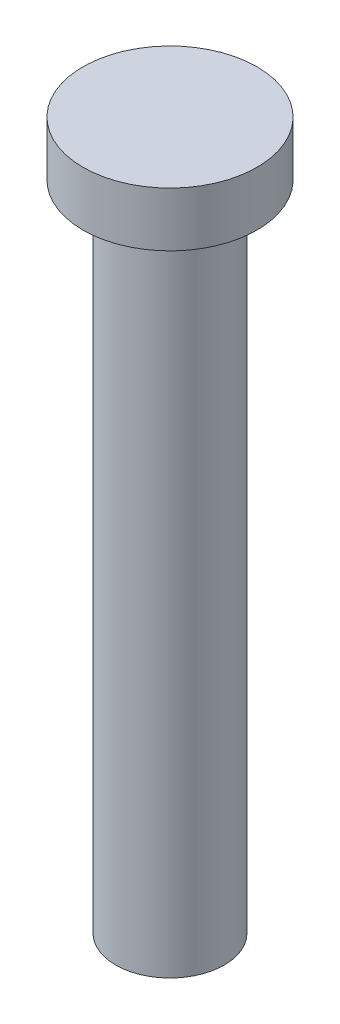
ISO-10303-21;
HEADER;
FILE_DESCRIPTION(('STEP AP214'),'2;1');
FILE_NAME('part.step','',(''),(''),'','','');
FILE_SCHEMA(('AUTOMOTIVE_DESIGN { 1 0 10303 214 1 1 1 1 }'));
ENDSEC;
DATA;
#1=APPLICATION_CONTEXT('core data for automotive mechanical design processes');
#2=APPLICATION_PROTOCOL_DEFINITION('international standard','automotive_design',2000,#1);
#3=PRODUCT_CONTEXT('',#1,'mechanical');
#4=PRODUCT('Part','Part','',(#3));
#5=PRODUCT_RELATED_PRODUCT_CATEGORY('part','',(#4));
#6=PRODUCT_DEFINITION_FORMATION('','',#4);
#7=PRODUCT_DEFINITION_CONTEXT('part definition',#1,'design');
#8=PRODUCT_DEFINITION('design','',#6,#7);
#9=PRODUCT_DEFINITION_SHAPE('','',#8);
#10=(LENGTH_UNIT() NAMED_UNIT(*) SI_UNIT(.MILLI.,.METRE.));
#11=(NAMED_UNIT(*) PLANE_ANGLE_UNIT() SI_UNIT($,.RADIAN.));
#12=(NAMED_UNIT(*) SI_UNIT($,.STERADIAN.) SOLID_ANGLE_UNIT());
#13=UNCERTAINTY_MEASURE_WITH_UNIT(LENGTH_MEASURE(1.E-05),#10,'distance_accuracy_value','');
#14=(GEOMETRIC_REPRESENTATION_CONTEXT(3) GLOBAL_UNCERTAINTY_ASSIGNED_CONTEXT((#13)) GLOBAL_UNIT_ASSIGNED_CONTEXT((#10,
#11,#12)) REPRESENTATION_CONTEXT('',''));
#15=CARTESIAN_POINT('',(0.,0.,0.));
#16=DIRECTION('',(0.,0.,1.));
#17=DIRECTION('',(1.,0.,0.));
#18=AXIS2_PLACEMENT_3D('',#15,#16,#17);
#19=CARTESIAN_POINT('',(0.,30.,0.));
#20=DIRECTION('',(0.,-1.,0.));
#21=DIRECTION('',(0.,0.,-1.));
#22=AXIS2_PLACEMENT_3D('',#19,#20,#21);
#23=CYLINDRICAL_SURFACE('',#22,2.5);
#24=CARTESIAN_POINT('',(0.,29.,0.));
#25=DIRECTION('',(0.,1.,0.));
#26=DIRECTION('',(0.,0.,1.));
#27=AXIS2_PLACEMENT_3D('',#24,#25,#26);
#28=CIRCLE('',#27,2.5);
#29=CARTESIAN_POINT('',(0.,29.,2.5));
#30=VERTEX_POINT('',#29);
#31=EDGE_CURVE('E10',#30,#30,#28,.F.);
#32=ORIENTED_EDGE('',*,*,#31,.T.);
#33=EDGE_LOOP('',(#32));
#34=FACE_BOUND('',#33,.T.);
#35=CARTESIAN_POINT('',(0.,0.,0.));
#36=DIRECTION('',(0.,1.,0.));
#37=DIRECTION('',(0.,0.,1.));
#38=AXIS2_PLACEMENT_3D('',#35,#36,#37);
#39=CIRCLE('',#38,2.5);
#40=CARTESIAN_POINT('',(0.,0.,2.5));
#41=VERTEX_POINT('',#40);
#42=EDGE_CURVE('E46',#41,#41,#39,.T.);
#43=ORIENTED_EDGE('',*,*,#42,.T.);
#44=EDGE_LOOP('',(#43));
#45=FACE_BOUND('',#44,.T.);
#46=ADVANCED_FACE('F35',(#34,#45),#23,.T.);
#47=CARTESIAN_POINT('',(0.,0.,0.));
#48=DIRECTION('',(0.,1.,0.));
#49=DIRECTION('',(0.,0.,1.));
#50=AXIS2_PLACEMENT_3D('',#47,#48,#49);
#51=PLANE('',#50);
#52=ORIENTED_EDGE('',*,*,#42,.F.);
#53=EDGE_LOOP('',(#52));
#54=FACE_BOUND('',#53,.T.);
#55=ADVANCED_FACE('F64',(#54),#51,.F.);
#56=CARTESIAN_POINT('',(0.,32.5,0.));
#57=DIRECTION('',(0.,-1.,0.));
#58=DIRECTION('',(0.,0.,-1.));
#59=AXIS2_PLACEMENT_3D('',#56,#57,#58);
#60=CYLINDRICAL_SURFACE('',#59,4.);
#61=CARTESIAN_POINT('',(0.,32.5,0.));
#62=DIRECTION('',(0.,1.,0.));
#63=DIRECTION('',(0.,0.,1.));
#64=AXIS2_PLACEMENT_3D('',#61,#62,#63);
#65=CIRCLE('',#64,4.);
#66=CARTESIAN_POINT('',(0.,32.5,4.));
#67=VERTEX_POINT('',#66);
#68=EDGE_CURVE('E50',#67,#67,#65,.T.);
#69=ORIENTED_EDGE('',*,*,#68,.F.);
#70=EDGE_LOOP('',(#69));
#71=FACE_BOUND('',#70,.T.);
#72=CARTESIAN_POINT('',(0.,30.,0.));
#73=DIRECTION('',(0.,1.,0.));
#74=DIRECTION('',(0.,0.,1.));
#75=AXIS2_PLACEMENT_3D('',#72,#73,#74);
#76=CIRCLE('',#75,4.);
#77=CARTESIAN_POINT('',(0.,30.,4.));
#78=VERTEX_POINT('',#77);
#79=EDGE_CURVE('E53',#78,#78,#76,.T.);
#80=ORIENTED_EDGE('',*,*,#79,.T.);
#81=EDGE_LOOP('',(#80));
#82=FACE_BOUND('',#81,.T.);
#83=ADVANCED_FACE('F61',(#71,#82),#60,.T.);
#84=CARTESIAN_POINT('',(0.,32.5,0.));
#85=DIRECTION('',(0.,1.,0.));
#86=DIRECTION('',(0.,0.,1.));
#87=AXIS2_PLACEMENT_3D('',#84,#85,#86);
#88=PLANE('',#87);
#89=ORIENTED_EDGE('',*,*,#68,.T.);
#90=EDGE_LOOP('',(#89));
#91=FACE_BOUND('',#90,.T.);
#92=ADVANCED_FACE('F59',(#91),#88,.T.);
#93=CARTESIAN_POINT('',(0.,30.,0.));
#94=DIRECTION('',(0.,1.,0.));
#95=DIRECTION('',(0.,0.,1.));
#96=AXIS2_PLACEMENT_3D('',#93,#94,#95);
#97=PLANE('',#96);
#98=CARTESIAN_POINT('',(0.,30.,0.));
#99=DIRECTION('',(0.,1.,0.));
#100=DIRECTION('',(0.,0.,1.));
#101=AXIS2_PLACEMENT_3D('',#98,#99,#100);
#102=CIRCLE('',#101,3.50000000000001);
#103=CARTESIAN_POINT('',(0.,30.,3.50000000000001));
#104=VERTEX_POINT('',#103);
#105=EDGE_CURVE('E42',#104,#104,#102,.T.);
#106=ORIENTED_EDGE('',*,*,#105,.T.);
#107=EDGE_LOOP('',(#106));
#108=FACE_BOUND('',#107,.T.);
#109=ORIENTED_EDGE('',*,*,#79,.F.);
#110=EDGE_LOOP('',(#109));
#111=FACE_BOUND('',#110,.T.);
#112=ADVANCED_FACE('F68',(#108,#111),#97,.F.);
#113=CARTESIAN_POINT('',(0.,30.,0.));
#114=DIRECTION('',(0.,1.,0.));
#115=DIRECTION('',(0.,0.,1.));
#116=AXIS2_PLACEMENT_3D('',#113,#114,#115);
#117=CONICAL_SURFACE('',#116,3.50000000000001,0.785398163397453);
#118=ORIENTED_EDGE('',*,*,#31,.F.);
#119=EDGE_LOOP('',(#118));
#120=FACE_BOUND('',#119,.T.);
#121=ORIENTED_EDGE('',*,*,#105,.F.);
#122=EDGE_LOOP('',(#121));
#123=FACE_BOUND('',#122,.T.);
#124=ADVANCED_FACE('F37',(#120,#123),#117,.T.);
#125=CLOSED_SHELL('',(#46,#55,#83,#92,#112,#124));
#126=MANIFOLD_SOLID_BREP('B2',#125);
#127=ADVANCED_BREP_SHAPE_REPRESENTATION('',(#18,#126),#14);
#128=SHAPE_DEFINITION_REPRESENTATION(#9,#127);
ENDSEC;
END-ISO-10303-21;
